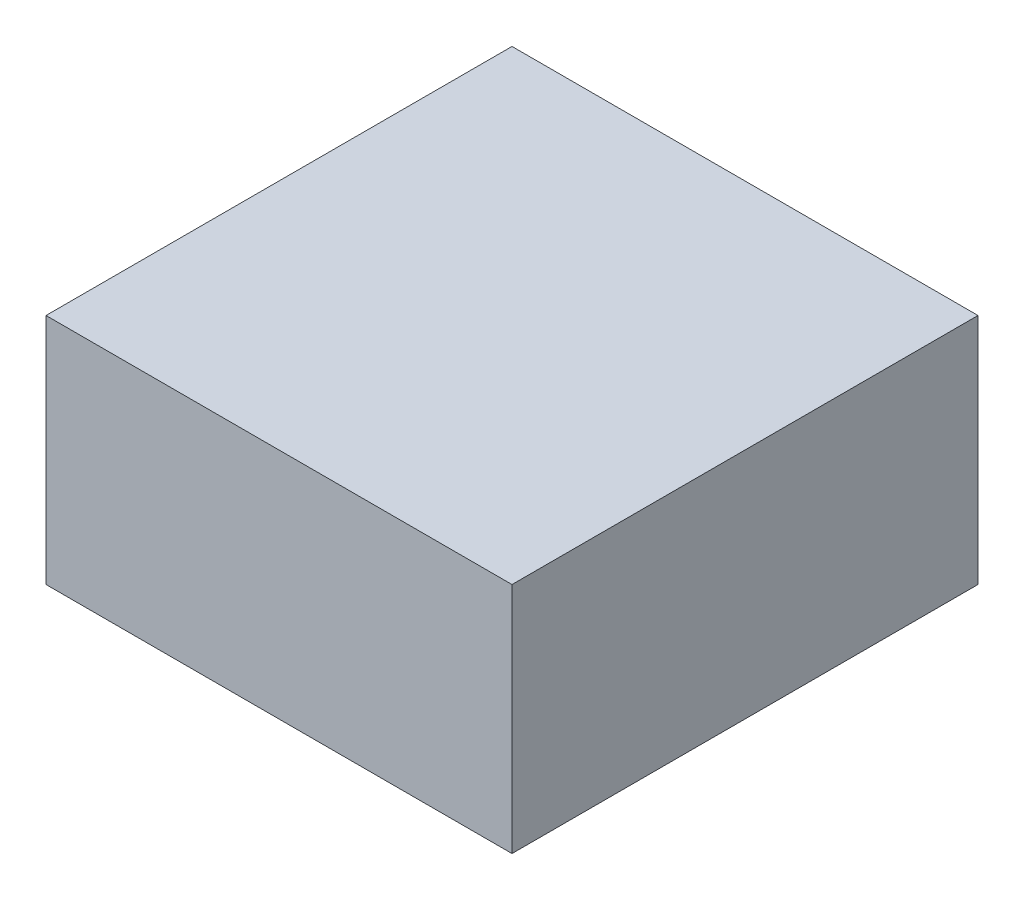
ISO-10303-21;
HEADER;
FILE_DESCRIPTION(('STEP AP214'),'2;1');
FILE_NAME('part.step','',(''),(''),'','','');
FILE_SCHEMA(('AUTOMOTIVE_DESIGN { 1 0 10303 214 1 1 1 1 }'));
ENDSEC;
DATA;
#1=APPLICATION_CONTEXT('core data for automotive mechanical design processes');
#2=APPLICATION_PROTOCOL_DEFINITION('international standard','automotive_design',2000,#1);
#3=PRODUCT_CONTEXT('',#1,'mechanical');
#4=PRODUCT('Part','Part','',(#3));
#5=PRODUCT_RELATED_PRODUCT_CATEGORY('part','',(#4));
#6=PRODUCT_DEFINITION_FORMATION('','',#4);
#7=PRODUCT_DEFINITION_CONTEXT('part definition',#1,'design');
#8=PRODUCT_DEFINITION('design','',#6,#7);
#9=PRODUCT_DEFINITION_SHAPE('','',#8);
#10=(LENGTH_UNIT() NAMED_UNIT(*) SI_UNIT(.MILLI.,.METRE.));
#11=(NAMED_UNIT(*) PLANE_ANGLE_UNIT() SI_UNIT($,.RADIAN.));
#12=(NAMED_UNIT(*) SI_UNIT($,.STERADIAN.) SOLID_ANGLE_UNIT());
#13=UNCERTAINTY_MEASURE_WITH_UNIT(LENGTH_MEASURE(1.E-05),#10,'distance_accuracy_value','');
#14=(GEOMETRIC_REPRESENTATION_CONTEXT(3) GLOBAL_UNCERTAINTY_ASSIGNED_CONTEXT((#13)) GLOBAL_UNIT_ASSIGNED_CONTEXT((#10,
#11,#12)) REPRESENTATION_CONTEXT('',''));
#15=CARTESIAN_POINT('',(0.,0.,0.));
#16=DIRECTION('',(0.,0.,1.));
#17=DIRECTION('',(1.,0.,0.));
#18=AXIS2_PLACEMENT_3D('',#15,#16,#17);
#19=CARTESIAN_POINT('',(10.,10.,10.));
#20=DIRECTION('',(-1.,0.,0.));
#21=DIRECTION('',(0.,0.,1.));
#22=AXIS2_PLACEMENT_3D('',#19,#20,#21);
#23=PLANE('',#22);
#24=DIRECTION('',(0.,0.,-1.));
#25=VECTOR('',#24,1.);
#26=CARTESIAN_POINT('',(10.,0.,10.));
#27=LINE('',#26,#25);
#28=CARTESIAN_POINT('',(10.,0.,10.));
#29=VERTEX_POINT('',#28);
#30=CARTESIAN_POINT('',(10.,0.,-10.));
#31=VERTEX_POINT('',#30);
#32=EDGE_CURVE('E96',#29,#31,#27,.T.);
#33=ORIENTED_EDGE('',*,*,#32,.T.);
#34=DIRECTION('',(0.,-1.,0.));
#35=VECTOR('',#34,1.);
#36=CARTESIAN_POINT('',(10.,10.,-10.));
#37=LINE('',#36,#35);
#38=CARTESIAN_POINT('',(10.,10.,-10.));
#39=VERTEX_POINT('',#38);
#40=EDGE_CURVE('E11',#39,#31,#37,.T.);
#41=ORIENTED_EDGE('',*,*,#40,.F.);
#42=DIRECTION('',(0.,0.,-1.));
#43=VECTOR('',#42,1.);
#44=CARTESIAN_POINT('',(10.,10.,10.));
#45=LINE('',#44,#43);
#46=CARTESIAN_POINT('',(10.,10.,10.));
#47=VERTEX_POINT('',#46);
#48=EDGE_CURVE('E84',#47,#39,#45,.T.);
#49=ORIENTED_EDGE('',*,*,#48,.F.);
#50=DIRECTION('',(0.,-1.,0.));
#51=VECTOR('',#50,1.);
#52=CARTESIAN_POINT('',(10.,10.,10.));
#53=LINE('',#52,#51);
#54=EDGE_CURVE('E92',#47,#29,#53,.T.);
#55=ORIENTED_EDGE('',*,*,#54,.T.);
#56=EDGE_LOOP('',(#33,#41,#49,#55));
#57=FACE_BOUND('',#56,.T.);
#58=ADVANCED_FACE('F33',(#57),#23,.F.);
#59=CARTESIAN_POINT('',(-10.,10.,-10.));
#60=DIRECTION('',(0.,0.,1.));
#61=DIRECTION('',(1.,0.,0.));
#62=AXIS2_PLACEMENT_3D('',#59,#60,#61);
#63=PLANE('',#62);
#64=DIRECTION('',(-1.,0.,0.));
#65=VECTOR('',#64,1.);
#66=CARTESIAN_POINT('',(-10.,0.,-10.));
#67=LINE('',#66,#65);
#68=CARTESIAN_POINT('',(-10.,0.,-10.));
#69=VERTEX_POINT('',#68);
#70=EDGE_CURVE('E88',#31,#69,#67,.T.);
#71=ORIENTED_EDGE('',*,*,#70,.T.);
#72=DIRECTION('',(0.,-1.,0.));
#73=VECTOR('',#72,1.);
#74=CARTESIAN_POINT('',(-10.,10.,-10.));
#75=LINE('',#74,#73);
#76=CARTESIAN_POINT('',(-10.,10.,-10.));
#77=VERTEX_POINT('',#76);
#78=EDGE_CURVE('E41',#77,#69,#75,.T.);
#79=ORIENTED_EDGE('',*,*,#78,.F.);
#80=DIRECTION('',(-1.,0.,0.));
#81=VECTOR('',#80,1.);
#82=CARTESIAN_POINT('',(-10.,10.,-10.));
#83=LINE('',#82,#81);
#84=EDGE_CURVE('E79',#39,#77,#83,.T.);
#85=ORIENTED_EDGE('',*,*,#84,.F.);
#86=ORIENTED_EDGE('',*,*,#40,.T.);
#87=EDGE_LOOP('',(#71,#79,#85,#86));
#88=FACE_BOUND('',#87,.T.);
#89=ADVANCED_FACE('F87',(#88),#63,.F.);
#90=CARTESIAN_POINT('',(-10.,10.,10.));
#91=DIRECTION('',(1.,0.,0.));
#92=DIRECTION('',(0.,0.,-1.));
#93=AXIS2_PLACEMENT_3D('',#90,#91,#92);
#94=PLANE('',#93);
#95=DIRECTION('',(0.,0.,1.));
#96=VECTOR('',#95,1.);
#97=CARTESIAN_POINT('',(-10.,0.,10.));
#98=LINE('',#97,#96);
#99=CARTESIAN_POINT('',(-10.,0.,10.));
#100=VERTEX_POINT('',#99);
#101=EDGE_CURVE('E66',#69,#100,#98,.T.);
#102=ORIENTED_EDGE('',*,*,#101,.T.);
#103=DIRECTION('',(0.,-1.,0.));
#104=VECTOR('',#103,1.);
#105=CARTESIAN_POINT('',(-10.,10.,10.));
#106=LINE('',#105,#104);
#107=CARTESIAN_POINT('',(-10.,10.,10.));
#108=VERTEX_POINT('',#107);
#109=EDGE_CURVE('E89',#108,#100,#106,.T.);
#110=ORIENTED_EDGE('',*,*,#109,.F.);
#111=DIRECTION('',(0.,0.,1.));
#112=VECTOR('',#111,1.);
#113=CARTESIAN_POINT('',(-10.,10.,10.));
#114=LINE('',#113,#112);
#115=EDGE_CURVE('E82',#77,#108,#114,.T.);
#116=ORIENTED_EDGE('',*,*,#115,.F.);
#117=ORIENTED_EDGE('',*,*,#78,.T.);
#118=EDGE_LOOP('',(#102,#110,#116,#117));
#119=FACE_BOUND('',#118,.T.);
#120=ADVANCED_FACE('F90',(#119),#94,.F.);
#121=CARTESIAN_POINT('',(-10.,10.,10.));
#122=DIRECTION('',(0.,0.,-1.));
#123=DIRECTION('',(-1.,0.,0.));
#124=AXIS2_PLACEMENT_3D('',#121,#122,#123);
#125=PLANE('',#124);
#126=DIRECTION('',(1.,0.,0.));
#127=VECTOR('',#126,1.);
#128=CARTESIAN_POINT('',(-10.,0.,10.));
#129=LINE('',#128,#127);
#130=EDGE_CURVE('E72',#100,#29,#129,.T.);
#131=ORIENTED_EDGE('',*,*,#130,.T.);
#132=ORIENTED_EDGE('',*,*,#54,.F.);
#133=DIRECTION('',(1.,0.,0.));
#134=VECTOR('',#133,1.);
#135=CARTESIAN_POINT('',(-10.,10.,10.));
#136=LINE('',#135,#134);
#137=EDGE_CURVE('E49',#108,#47,#136,.T.);
#138=ORIENTED_EDGE('',*,*,#137,.F.);
#139=ORIENTED_EDGE('',*,*,#109,.T.);
#140=EDGE_LOOP('',(#131,#132,#138,#139));
#141=FACE_BOUND('',#140,.T.);
#142=ADVANCED_FACE('F104',(#141),#125,.F.);
#143=CARTESIAN_POINT('',(0.,10.,0.));
#144=DIRECTION('',(0.,-1.,0.));
#145=DIRECTION('',(0.,0.,-1.));
#146=AXIS2_PLACEMENT_3D('',#143,#144,#145);
#147=PLANE('',#146);
#148=ORIENTED_EDGE('',*,*,#48,.T.);
#149=ORIENTED_EDGE('',*,*,#84,.T.);
#150=ORIENTED_EDGE('',*,*,#115,.T.);
#151=ORIENTED_EDGE('',*,*,#137,.T.);
#152=EDGE_LOOP('',(#148,#149,#150,#151));
#153=FACE_BOUND('',#152,.T.);
#154=ADVANCED_FACE('F80',(#153),#147,.F.);
#155=CARTESIAN_POINT('',(0.,0.,0.));
#156=DIRECTION('',(0.,-1.,0.));
#157=DIRECTION('',(0.,0.,-1.));
#158=AXIS2_PLACEMENT_3D('',#155,#156,#157);
#159=PLANE('',#158);
#160=CARTESIAN_POINT('',(0.,0.,0.));
#161=DIRECTION('',(0.,1.,0.));
#162=DIRECTION('',(-0.91076648377171,0.,-0.412921798937906));
#163=AXIS2_PLACEMENT_3D('',#160,#161,#162);
#164=CIRCLE('',#163,6.);
#165=CARTESIAN_POINT('',(-5.46459890263026,0.,-2.47753079362744));
#166=VERTEX_POINT('',#165);
#167=EDGE_CURVE('E118',#166,#166,#164,.T.);
#168=ORIENTED_EDGE('',*,*,#167,.T.);
#169=EDGE_LOOP('',(#168));
#170=FACE_BOUND('',#169,.T.);
#171=ORIENTED_EDGE('',*,*,#32,.F.);
#172=ORIENTED_EDGE('',*,*,#130,.F.);
#173=ORIENTED_EDGE('',*,*,#101,.F.);
#174=ORIENTED_EDGE('',*,*,#70,.F.);
#175=EDGE_LOOP('',(#171,#172,#173,#174));
#176=FACE_BOUND('',#175,.T.);
#177=ADVANCED_FACE('F107',(#170,#176),#159,.T.);
#178=CARTESIAN_POINT('',(0.,5.9,0.));
#179=DIRECTION('',(0.,-1.,0.));
#180=DIRECTION('',(0.91076648377171,0.,0.412921798937906));
#181=AXIS2_PLACEMENT_3D('',#178,#179,#180);
#182=PLANE('',#181);
#183=CARTESIAN_POINT('',(0.,5.9,0.));
#184=DIRECTION('',(0.,1.,0.));
#185=DIRECTION('',(-0.91076648377171,0.,-0.412921798937906));
#186=AXIS2_PLACEMENT_3D('',#183,#184,#185);
#187=CIRCLE('',#186,2.5);
#188=CARTESIAN_POINT('',(-2.27691620942927,5.9,-1.03230449734476));
#189=VERTEX_POINT('',#188);
#190=EDGE_CURVE('E99',#189,#189,#187,.T.);
#191=ORIENTED_EDGE('',*,*,#190,.F.);
#192=EDGE_LOOP('',(#191));
#193=FACE_BOUND('',#192,.T.);
#194=ADVANCED_FACE('F147',(#193),#182,.T.);
#195=CARTESIAN_POINT('',(0.,5.9,0.));
#196=DIRECTION('',(0.,1.,0.));
#197=DIRECTION('',(-0.91076648377171,0.,-0.412921798937906));
#198=AXIS2_PLACEMENT_3D('',#195,#196,#197);
#199=CYLINDRICAL_SURFACE('',#198,2.5);
#200=ORIENTED_EDGE('',*,*,#190,.T.);
#201=EDGE_LOOP('',(#200));
#202=FACE_BOUND('',#201,.T.);
#203=CARTESIAN_POINT('',(0.,7.9,0.));
#204=DIRECTION('',(0.,1.,0.));
#205=DIRECTION('',(-0.91076648377171,0.,-0.412921798937906));
#206=AXIS2_PLACEMENT_3D('',#203,#204,#205);
#207=CIRCLE('',#206,2.5);
#208=CARTESIAN_POINT('',(-2.27691620942927,7.9,-1.03230449734476));
#209=VERTEX_POINT('',#208);
#210=EDGE_CURVE('E112',#209,#209,#207,.T.);
#211=ORIENTED_EDGE('',*,*,#210,.F.);
#212=EDGE_LOOP('',(#211));
#213=FACE_BOUND('',#212,.T.);
#214=ADVANCED_FACE('F131',(#202,#213),#199,.T.);
#215=CARTESIAN_POINT('',(0.,2.43343537079642,0.));
#216=DIRECTION('',(0.,1.,0.));
#217=DIRECTION('',(-0.91076648377171,0.,-0.412921798937906));
#218=AXIS2_PLACEMENT_3D('',#215,#216,#217);
#219=DEGENERATE_TOROIDAL_SURFACE('',#218,0.0268095191149806,6.,.T.);
#220=ORIENTED_EDGE('',*,*,#210,.T.);
#221=EDGE_LOOP('',(#220));
#222=FACE_BOUND('',#221,.T.);
#223=CARTESIAN_POINT('',(0.,3.,0.));
#224=DIRECTION('',(0.,1.,0.));
#225=DIRECTION('',(-0.91076648377171,0.,-0.412921798937906));
#226=AXIS2_PLACEMENT_3D('',#223,#224,#225);
#227=CIRCLE('',#226,6.);
#228=CARTESIAN_POINT('',(-5.46459890263026,3.,-2.47753079362744));
#229=VERTEX_POINT('',#228);
#230=EDGE_CURVE('E115',#229,#229,#227,.T.);
#231=ORIENTED_EDGE('',*,*,#230,.F.);
#232=EDGE_LOOP('',(#231));
#233=FACE_BOUND('',#232,.T.);
#234=ADVANCED_FACE('F125',(#222,#233),#219,.F.);
#235=CARTESIAN_POINT('',(0.,5.9,0.));
#236=DIRECTION('',(0.,1.,0.));
#237=DIRECTION('',(-0.91076648377171,0.,-0.412921798937906));
#238=AXIS2_PLACEMENT_3D('',#235,#236,#237);
#239=CYLINDRICAL_SURFACE('',#238,6.);
#240=ORIENTED_EDGE('',*,*,#230,.T.);
#241=EDGE_LOOP('',(#240));
#242=FACE_BOUND('',#241,.T.);
#243=ORIENTED_EDGE('',*,*,#167,.F.);
#244=EDGE_LOOP('',(#243));
#245=FACE_BOUND('',#244,.T.);
#246=ADVANCED_FACE('F123',(#242,#245),#239,.F.);
#247=CLOSED_SHELL('',(#58,#89,#120,#142,#154,#177,#194,#214,#234,#246));
#248=MANIFOLD_SOLID_BREP('B2',#247);
#249=ADVANCED_BREP_SHAPE_REPRESENTATION('',(#18,#248),#14);
#250=SHAPE_DEFINITION_REPRESENTATION(#9,#249);
ENDSEC;
END-ISO-10303-21;
